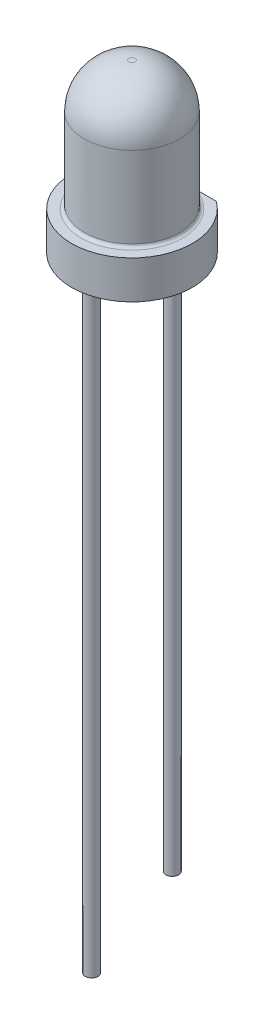
ISO-10303-21;
HEADER;
FILE_DESCRIPTION(('STEP AP214'),'2;1');
FILE_NAME('part.step','',(''),(''),'','','');
FILE_SCHEMA(('AUTOMOTIVE_DESIGN { 1 0 10303 214 1 1 1 1 }'));
ENDSEC;
DATA;
#1=APPLICATION_CONTEXT('core data for automotive mechanical design processes');
#2=APPLICATION_PROTOCOL_DEFINITION('international standard','automotive_design',2000,#1);
#3=PRODUCT_CONTEXT('',#1,'mechanical');
#4=PRODUCT('Part','Part','',(#3));
#5=PRODUCT_RELATED_PRODUCT_CATEGORY('part','',(#4));
#6=PRODUCT_DEFINITION_FORMATION('','',#4);
#7=PRODUCT_DEFINITION_CONTEXT('part definition',#1,'design');
#8=PRODUCT_DEFINITION('design','',#6,#7);
#9=PRODUCT_DEFINITION_SHAPE('','',#8);
#10=(LENGTH_UNIT() NAMED_UNIT(*) SI_UNIT(.MILLI.,.METRE.));
#11=(NAMED_UNIT(*) PLANE_ANGLE_UNIT() SI_UNIT($,.RADIAN.));
#12=(NAMED_UNIT(*) SI_UNIT($,.STERADIAN.) SOLID_ANGLE_UNIT());
#13=UNCERTAINTY_MEASURE_WITH_UNIT(LENGTH_MEASURE(1.E-05),#10,'distance_accuracy_value','');
#14=(GEOMETRIC_REPRESENTATION_CONTEXT(3) GLOBAL_UNCERTAINTY_ASSIGNED_CONTEXT((#13)) GLOBAL_UNIT_ASSIGNED_CONTEXT((#10,
#11,#12)) REPRESENTATION_CONTEXT('',''));
#15=CARTESIAN_POINT('',(0.,0.,0.));
#16=DIRECTION('',(0.,0.,1.));
#17=DIRECTION('',(1.,0.,0.));
#18=AXIS2_PLACEMENT_3D('',#15,#16,#17);
#19=CARTESIAN_POINT('',(0.,0.,0.));
#20=DIRECTION('',(0.,-1.,0.));
#21=DIRECTION('',(0.,0.,-1.));
#22=AXIS2_PLACEMENT_3D('',#19,#20,#21);
#23=PLANE('',#22);
#24=CARTESIAN_POINT('',(0.,0.,-1.27));
#25=DIRECTION('',(0.,-1.,0.));
#26=DIRECTION('',(0.,0.,-1.));
#27=AXIS2_PLACEMENT_3D('',#24,#25,#26);
#28=CIRCLE('',#27,0.2);
#29=CARTESIAN_POINT('',(0.,0.,-1.47));
#30=VERTEX_POINT('',#29);
#31=EDGE_CURVE('E312',#30,#30,#28,.T.);
#32=ORIENTED_EDGE('',*,*,#31,.F.);
#33=EDGE_LOOP('',(#32));
#34=FACE_BOUND('',#33,.T.);
#35=CARTESIAN_POINT('',(0.,0.,1.27));
#36=DIRECTION('',(0.,-1.,0.));
#37=DIRECTION('',(0.,0.,-1.));
#38=AXIS2_PLACEMENT_3D('',#35,#36,#37);
#39=CIRCLE('',#38,0.2);
#40=CARTESIAN_POINT('',(0.,0.,1.07));
#41=VERTEX_POINT('',#40);
#42=EDGE_CURVE('E133',#41,#41,#39,.T.);
#43=ORIENTED_EDGE('',*,*,#42,.F.);
#44=EDGE_LOOP('',(#43));
#45=FACE_BOUND('',#44,.T.);
#46=CARTESIAN_POINT('',(0.,0.,0.));
#47=DIRECTION('',(0.,-1.,0.));
#48=DIRECTION('',(0.,0.,-1.));
#49=AXIS2_PLACEMENT_3D('',#46,#47,#48);
#50=CIRCLE('',#49,1.9);
#51=CARTESIAN_POINT('',(1.15393997640077,0.,-1.50944444444445));
#52=VERTEX_POINT('',#51);
#53=CARTESIAN_POINT('',(-1.15393997640077,0.,-1.50944444444445));
#54=VERTEX_POINT('',#53);
#55=EDGE_CURVE('E126',#52,#54,#50,.T.);
#56=ORIENTED_EDGE('',*,*,#55,.T.);
#57=CARTESIAN_POINT('',(-1.09320629343231,0.,-1.43));
#58=DIRECTION('',(0.,-1.,0.));
#59=DIRECTION('',(0.,0.,-1.));
#60=AXIS2_PLACEMENT_3D('',#57,#58,#59);
#61=CIRCLE('',#60,0.1);
#62=CARTESIAN_POINT('',(-1.09320629343231,0.,-1.53));
#63=VERTEX_POINT('',#62);
#64=EDGE_CURVE('E182',#54,#63,#61,.T.);
#65=ORIENTED_EDGE('',*,*,#64,.T.);
#66=DIRECTION('',(1.,0.,0.));
#67=VECTOR('',#66,1.);
#68=CARTESIAN_POINT('',(-1.5,0.,-1.53));
#69=LINE('',#68,#67);
#70=CARTESIAN_POINT('',(1.09320629343231,0.,-1.53));
#71=VERTEX_POINT('',#70);
#72=EDGE_CURVE('E116',#63,#71,#69,.T.);
#73=ORIENTED_EDGE('',*,*,#72,.T.);
#74=CARTESIAN_POINT('',(1.09320629343231,0.,-1.43));
#75=DIRECTION('',(0.,-1.,0.));
#76=DIRECTION('',(0.,0.,-1.));
#77=AXIS2_PLACEMENT_3D('',#74,#75,#76);
#78=CIRCLE('',#77,0.1);
#79=EDGE_CURVE('E209',#71,#52,#78,.T.);
#80=ORIENTED_EDGE('',*,*,#79,.T.);
#81=EDGE_LOOP('',(#56,#65,#73,#80));
#82=FACE_BOUND('',#81,.T.);
#83=ADVANCED_FACE('F36',(#34,#45,#82),#23,.T.);
#84=CARTESIAN_POINT('',(0.1,5.25,0.));
#85=DIRECTION('',(0.,1.,0.));
#86=DIRECTION('',(0.,0.,1.));
#87=AXIS2_PLACEMENT_3D('',#84,#85,#86);
#88=PLANE('',#87);
#89=CARTESIAN_POINT('',(0.,5.25,0.));
#90=DIRECTION('',(0.,-1.,0.));
#91=DIRECTION('',(0.,0.,-1.));
#92=AXIS2_PLACEMENT_3D('',#89,#90,#91);
#93=CIRCLE('',#92,0.1);
#94=CARTESIAN_POINT('',(0.,5.25,-0.1));
#95=VERTEX_POINT('',#94);
#96=EDGE_CURVE('E194',#95,#95,#93,.T.);
#97=ORIENTED_EDGE('',*,*,#96,.F.);
#98=EDGE_LOOP('',(#97));
#99=FACE_BOUND('',#98,.T.);
#100=ADVANCED_FACE('F161',(#99),#88,.T.);
#101=CARTESIAN_POINT('',(0.,3.85,0.));
#102=DIRECTION('',(0.,-1.,0.));
#103=DIRECTION('',(0.,0.,-1.));
#104=AXIS2_PLACEMENT_3D('',#101,#102,#103);
#105=DEGENERATE_TOROIDAL_SURFACE('',#104,0.1,1.4,.T.);
#106=ORIENTED_EDGE('',*,*,#96,.T.);
#107=EDGE_LOOP('',(#106));
#108=FACE_BOUND('',#107,.T.);
#109=CARTESIAN_POINT('',(0.,3.85,0.));
#110=DIRECTION('',(0.,-1.,0.));
#111=DIRECTION('',(0.,0.,-1.));
#112=AXIS2_PLACEMENT_3D('',#109,#110,#111);
#113=CIRCLE('',#112,1.5);
#114=CARTESIAN_POINT('',(0.,3.85,-1.5));
#115=VERTEX_POINT('',#114);
#116=EDGE_CURVE('E197',#115,#115,#113,.T.);
#117=ORIENTED_EDGE('',*,*,#116,.F.);
#118=EDGE_LOOP('',(#117));
#119=FACE_BOUND('',#118,.T.);
#120=ADVANCED_FACE('F167',(#108,#119),#105,.T.);
#121=CARTESIAN_POINT('',(0.,0.,0.));
#122=DIRECTION('',(0.,-1.,0.));
#123=DIRECTION('',(0.,0.,-1.));
#124=AXIS2_PLACEMENT_3D('',#121,#122,#123);
#125=CYLINDRICAL_SURFACE('',#124,1.5);
#126=CARTESIAN_POINT('',(0.596635949045258,1.27844838329799,-1.37623600603489));
#127=CARTESIAN_POINT('',(0.579988654836086,1.22074362828819,-1.38345306338259));
#128=CARTESIAN_POINT('',(0.593571128968101,1.19395535467138,-1.43595984261225));
#129=CARTESIAN_POINT('',(0.607153603100116,1.16716708105457,-1.4884666218419));
#130=CARTESIAN_POINT('',(0.636411678981608,1.2,-1.53));
#131=CARTESIAN_POINT('',(0.585036841780166,1.28263813999001,-1.38126781091185));
#132=CARTESIAN_POINT('',(0.571302463719679,1.22599416612077,-1.38706443709447));
#133=CARTESIAN_POINT('',(0.584305659045327,1.19828171330966,-1.43698733020298));
#134=CARTESIAN_POINT('',(0.597479746886338,1.17050639970074,-1.48687857662004));
#135=CARTESIAN_POINT('',(0.624039297898998,1.2,-1.53));
#136=CARTESIAN_POINT('',(0.573187867718047,1.28599119272939,-1.38622735770545));
#137=CARTESIAN_POINT('',(0.561678229660388,1.23060501398405,-1.39097132711862));
#138=CARTESIAN_POINT('',(0.574226791445767,1.20220692852279,-1.43848650602435));
#139=CARTESIAN_POINT('',(0.586930229864933,1.17376106597824,-1.48597256818874));
#140=CARTESIAN_POINT('',(0.61140039223266,1.2,-1.53));
#141=CARTESIAN_POINT('',(0.549178576915518,1.2913921514648,-1.39591095345598));
#142=CARTESIAN_POINT('',(0.541297577119814,1.2386162598478,-1.3989909676858));
#143=CARTESIAN_POINT('',(0.552983697349845,1.2092767962256,-1.44206424442007));
#144=CARTESIAN_POINT('',(0.564815785403716,1.17988505157303,-1.48511591745898));
#145=CARTESIAN_POINT('',(0.585790482043143,1.2,-1.53));
#146=CARTESIAN_POINT('',(0.537019422386753,1.29344434684456,-1.40063572853451));
#147=CARTESIAN_POINT('',(0.530537683708682,1.24204647830918,-1.40310920461877));
#148=CARTESIAN_POINT('',(0.541823179280551,1.21242399295138,-1.44414087000428));
#149=CARTESIAN_POINT('',(0.553243424841939,1.18276788571251,-1.48514789033228));
#150=CARTESIAN_POINT('',(0.572820717212384,1.2,-1.53));
#151=CARTESIAN_POINT('',(0.512616344627985,1.2966193956014,-1.40974943255995));
#152=CARTESIAN_POINT('',(0.508480507002836,1.24788019580522,-1.41124206800611));
#153=CARTESIAN_POINT('',(0.518999560235381,1.2179612194423,-1.44850016292976));
#154=CARTESIAN_POINT('',(0.529651702044954,1.18801086515299,-1.48573176900494));
#155=CARTESIAN_POINT('',(0.546790767603336,1.2,-1.53));
#156=CARTESIAN_POINT('',(0.500374338951784,1.29775093441029,-1.41414113720348));
#157=CARTESIAN_POINT('',(0.497178556171205,1.25030934586726,-1.41526471895034));
#158=CARTESIAN_POINT('',(0.507342274687659,1.22035819106882,-1.4507806739017));
#159=CARTESIAN_POINT('',(0.517624678401709,1.19038570693231,-1.48627323443446));
#160=CARTESIAN_POINT('',(0.533732628215766,1.2,-1.53));
#161=CARTESIAN_POINT('',(0.475735547941032,1.29931674867054,-1.42261924900392));
#162=CARTESIAN_POINT('',(0.47412551748095,1.25438269775188,-1.42314955042351));
#163=CARTESIAN_POINT('',(0.483596203260389,1.2245481664658,-1.45542113040316));
#164=CARTESIAN_POINT('',(0.49318342175339,1.1946934570346,-1.48767013672499));
#165=CARTESIAN_POINT('',(0.507451251137652,1.2,-1.53));
#166=CARTESIAN_POINT('',(0.463338632072527,1.2997503896142,-1.426705375124));
#167=CARTESIAN_POINT('',(0.462361785715185,1.25603684322798,-1.42701885718742));
#168=CARTESIAN_POINT('',(0.47150703491985,1.22634061945737,-1.45778114622854));
#169=CARTESIAN_POINT('',(0.480754989806089,1.19663341865014,-1.48852378191264));
#170=CARTESIAN_POINT('',(0.494227874210891,1.2,-1.53));
#171=CARTESIAN_POINT('',(0.41471094272655,1.30041340749933,-1.44203056474712));
#172=CARTESIAN_POINT('',(0.416213299518517,1.261222769485,-1.44154104006249));
#173=CARTESIAN_POINT('',(0.423733878620772,1.23235282442122,-1.46692270832985));
#174=CARTESIAN_POINT('',(0.432123864507955,1.20336789692869,-1.49213801328945));
#175=CARTESIAN_POINT('',(0.44235833890775,1.2,-1.53));
#176=CARTESIAN_POINT('',(0.378077766422061,1.29867898574596,-1.45206286838238));
#177=CARTESIAN_POINT('',(0.380169640792389,1.26255365008559,-1.45151257699511));
#178=CARTESIAN_POINT('',(0.38698553795431,1.23468939564989,-1.47356029599259));
#179=CARTESIAN_POINT('',(0.394401907167303,1.20679996719503,-1.49551475520822));
#180=CARTESIAN_POINT('',(0.4032829508504,1.2,-1.53));
#181=CARTESIAN_POINT('',(0.30425871854931,1.2932828552766,-1.46930957357808));
#182=CARTESIAN_POINT('',(0.307079951419319,1.26250202741913,-1.46871132062124));
#183=CARTESIAN_POINT('',(0.31233461227565,1.23698092941371,-1.48535267215074));
#184=CARTESIAN_POINT('',(0.318173795207326,1.21144853710192,-1.50190011559484));
#185=CARTESIAN_POINT('',(0.324542633119835,1.2,-1.53));
#186=CARTESIAN_POINT('',(0.267071892964728,1.28961732179085,-1.47651833323522));
#187=CARTESIAN_POINT('',(0.269807489469149,1.26115657812262,-1.47603269280316));
#188=CARTESIAN_POINT('',(0.274429877766994,1.23693114785473,-1.49050448646882));
#189=CARTESIAN_POINT('',(0.279427902981026,1.21271070690526,-1.50493476730807));
#190=CARTESIAN_POINT('',(0.284876685829209,1.2,-1.53));
#191=CARTESIAN_POINT('',(0.192041759882336,1.28223633010451,-1.48814264083676));
#192=CARTESIAN_POINT('',(0.194448175117998,1.2576845929024,-1.48783135106648));
#193=CARTESIAN_POINT('',(0.197652369009453,1.23588414150975,-1.49894144908285));
#194=CARTESIAN_POINT('',(0.201230232249616,1.21408891846235,-1.51001071885433));
#195=CARTESIAN_POINT('',(0.204844543874352,1.2,-1.53));
#196=CARTESIAN_POINT('',(0.154195919935727,1.27852070647174,-1.49254204929815));
#197=CARTESIAN_POINT('',(0.156163965999515,1.25555199056608,-1.49235163064919));
#198=CARTESIAN_POINT('',(0.158775311449008,1.23488152319566,-1.50221580073815));
#199=CARTESIAN_POINT('',(0.161573097274758,1.21421329490168,-1.51206957814087));
#200=CARTESIAN_POINT('',(0.164475647931405,1.2,-1.53));
#201=CARTESIAN_POINT('',(0.078213791192061,1.27313765714223,-1.49844202742775));
#202=CARTESIAN_POINT('',(0.0793316733717928,1.25236443947991,-1.49839249164291));
#203=CARTESIAN_POINT('',(0.0805991124199562,1.23329053926251,-1.50662579467846));
#204=CARTESIAN_POINT('',(0.0820482117256914,1.21422188025386,-1.51484872637576));
#205=CARTESIAN_POINT('',(0.0834280439382357,1.2,-1.53));
#206=CARTESIAN_POINT('',(0.0400784190140926,1.27146533050907,-1.49994953841275));
#207=CARTESIAN_POINT('',(0.0406074388213395,1.25129448361804,-1.49994828479541));
#208=CARTESIAN_POINT('',(0.0413012098826571,1.23270118386836,-1.50776655797306));
#209=CARTESIAN_POINT('',(0.0419976948104199,1.21410780763926,-1.51558492151257));
#210=CARTESIAN_POINT('',(0.0427503136150422,1.2,-1.53));
#211=CARTESIAN_POINT('',(-0.0369667796354504,1.27136485923424,-1.50004894388315));
#212=CARTESIAN_POINT('',(-0.037451767744919,1.25123255682875,-1.5000501519944));
#213=CARTESIAN_POINT('',(-0.0380946287051991,1.23266827187658,-1.50784140770821));
#214=CARTESIAN_POINT('',(-0.0387339859337747,1.2141040675329,-1.51563256534065));
#215=CARTESIAN_POINT('',(-0.0394312316111574,1.2,-1.53));
#216=CARTESIAN_POINT('',(-0.0758767848599048,1.27300251396075,-1.49858170121813));
#217=CARTESIAN_POINT('',(-0.0769686631054567,1.2522824653133,-1.49853559503684));
#218=CARTESIAN_POINT('',(-0.0781927885150225,1.23324795415863,-1.50673073642604));
#219=CARTESIAN_POINT('',(-0.0796032813064427,1.21421892907304,-1.51491531115792));
#220=CARTESIAN_POINT('',(-0.0809352371839013,1.2,-1.53));
#221=CARTESIAN_POINT('',(-0.153405059561358,1.27843408641926,-1.49264377719626));
#222=CARTESIAN_POINT('',(-0.15536898568105,1.25550238502165,-1.49245548351361));
#223=CARTESIAN_POINT('',(-0.157963440051553,1.23485815676662,-1.50229127066718));
#224=CARTESIAN_POINT('',(-0.160749384521687,1.21421605686533,-1.51211659706847));
#225=CARTESIAN_POINT('',(-0.163632063532112,1.2,-1.53));
#226=CARTESIAN_POINT('',(-0.192022281181801,1.28223371326418,-1.48816513794087));
#227=CARTESIAN_POINT('',(-0.194439211654154,1.2576886068525,-1.4878523459794));
#228=CARTESIAN_POINT('',(-0.197634520231691,1.23588986910119,-1.49895659925115));
#229=CARTESIAN_POINT('',(-0.201220003891631,1.21409658323617,-1.510018136887));
#230=CARTESIAN_POINT('',(-0.204823766593921,1.2,-1.53));
#231=CARTESIAN_POINT('',(-0.268660382395489,1.28977423475865,-1.47625242622609));
#232=CARTESIAN_POINT('',(-0.271409661781654,1.26122578895328,-1.47576172149049));
#233=CARTESIAN_POINT('',(-0.276053266062757,1.23694716925973,-1.49031267276247));
#234=CARTESIAN_POINT('',(-0.281091372471785,1.21267367601031,-1.50481984447215));
#235=CARTESIAN_POINT('',(-0.286571074555189,1.2,-1.53));
#236=CARTESIAN_POINT('',(-0.306682829490062,1.29351528382897,-1.46882833250248));
#237=CARTESIAN_POINT('',(-0.309517382781105,1.26258105276251,-1.46822109991684));
#238=CARTESIAN_POINT('',(-0.314803586057846,1.23697612531768,-1.48501008854549));
#239=CARTESIAN_POINT('',(-0.320708404402393,1.21135833529395,-1.50169876563366));
#240=CARTESIAN_POINT('',(-0.327128351456066,1.2,-1.53));
#241=CARTESIAN_POINT('',(-0.38211659886271,1.29891233437488,-1.45102703848495));
#242=CARTESIAN_POINT('',(-0.384160774280792,1.26247032543957,-1.4504823096191));
#243=CARTESIAN_POINT('',(-0.391049347918864,1.23448669578774,-1.47286822446213));
#244=CARTESIAN_POINT('',(-0.398572869870511,1.20647489908179,-1.49515485007498));
#245=CARTESIAN_POINT('',(-0.40759103878689,1.2,-1.53));
#246=CARTESIAN_POINT('',(-0.419529334626983,1.30057414689707,-1.44065816834881));
#247=CARTESIAN_POINT('',(-0.4209412107273,1.26096487084678,-1.4401839984387));
#248=CARTESIAN_POINT('',(-0.428548000768911,1.23197544529759,-1.46603329061811));
#249=CARTESIAN_POINT('',(-0.437079374618921,1.20285817027594,-1.49170446778168));
#250=CARTESIAN_POINT('',(-0.447497956935449,1.2,-1.53));
#251=CARTESIAN_POINT('',(-0.468791184304815,1.29957738484036,-1.4249221530695));
#252=CARTESIAN_POINT('',(-0.467539174030466,1.25533306146782,-1.42532998072905));
#253=CARTESIAN_POINT('',(-0.476829345937057,1.22557093742464,-1.45674740230909));
#254=CARTESIAN_POINT('',(-0.486222733276246,1.19579689151023,-1.48814507156556));
#255=CARTESIAN_POINT('',(-0.500043929925136,1.2,-1.53));
#256=CARTESIAN_POINT('',(-0.481078358933183,1.29905844422898,-1.42082037197495));
#257=CARTESIAN_POINT('',(-0.479162158946364,1.25358914282929,-1.42146038584177));
#258=CARTESIAN_POINT('',(-0.488779133791034,1.22371054839857,-1.4544069674999));
#259=CARTESIAN_POINT('',(-0.498513274808875,1.19380982550644,-1.48733118860187));
#260=CARTESIAN_POINT('',(-0.513150249528728,1.2,-1.53));
#261=CARTESIAN_POINT('',(-0.505524926485509,1.29729897943894,-1.41230757412135));
#262=CARTESIAN_POINT('',(-0.50194085216485,1.24931724873431,-1.41358324462378));
#263=CARTESIAN_POINT('',(-0.51225544594631,1.21937200423796,-1.44982187734587));
#264=CARTESIAN_POINT('',(-0.522689394944279,1.18940518358734,-1.48603666998433));
#265=CARTESIAN_POINT('',(-0.539226588251209,1.2,-1.53));
#266=CARTESIAN_POINT('',(-0.517684019402311,1.29605703333797,-1.40789596310237));
#267=CARTESIAN_POINT('',(-0.513107339978204,1.24677661967967,-1.40956831709867));
#268=CARTESIAN_POINT('',(-0.523781088462639,1.21689263727398,-1.44757742012227));
#269=CARTESIAN_POINT('',(-0.534587524046544,1.18697917026052,-1.48555916245719));
#270=CARTESIAN_POINT('',(-0.552196287362465,1.2,-1.53));
#271=CARTESIAN_POINT('',(-0.52974592643691,1.2943624851959,-1.4033421726092));
#272=CARTESIAN_POINT('',(-0.523882563776283,1.24377450108468,-1.40555552623408));
#273=CARTESIAN_POINT('',(-0.535005835081248,1.21405404063005,-1.44544774550345));
#274=CARTESIAN_POINT('',(-0.546129106386214,1.18433358017542,-1.48533996477283));
#275=CARTESIAN_POINT('',(-0.565062321532704,1.2,-1.53));
#276=(BOUNDED_SURFACE() B_SPLINE_SURFACE(3,2,((#126,#127,#128,#129,#130),(#131,#132,#133,#134,
#135),(#136,#137,#138,#139,#140),(#141,#142,#143,#144,#145),(#146,#147,#148,#149,#150),(#151,
#152,#153,#154,#155),(#156,#157,#158,#159,#160),(#161,#162,#163,#164,#165),(#166,#167,#168,#169,
#170),(#171,#172,#173,#174,#175),(#176,#177,#178,#179,#180),(#181,#182,#183,#184,#185),(#186,
#187,#188,#189,#190),(#191,#192,#193,#194,#195),(#196,#197,#198,#199,#200),(#201,#202,#203,#204,
#205),(#206,#207,#208,#209,#210),(#211,#212,#213,#214,#215),(#216,#217,#218,#219,#220),(#221,
#222,#223,#224,#225),(#226,#227,#228,#229,#230),(#231,#232,#233,#234,#235),(#236,#237,#238,#239,
#240),(#241,#242,#243,#244,#245),(#246,#247,#248,#249,#250),(#251,#252,#253,#254,#255),(#256,
#257,#258,#259,#260),(#261,#262,#263,#264,#265),(#266,#267,#268,#269,#270),(#271,#272,#273,#274,
#275)),.UNSPECIFIED.,.F.,.F.,.F.) B_SPLINE_SURFACE_WITH_KNOTS((4,2,2,2,2,2,2,2,2,2,2,2,2,2,4),
(3,2,3),(0.,0.0422764840743587,0.0844128324877446,0.126146902745886,0.167918894971379,
0.28928862457798,0.410899648455466,0.533203176922212,0.655212775535734,0.779671660012366,
0.904460738177825,1.02883061205741,1.15285211513145,1.19431278140056,1.23585526443215),(0.,0.5,
1.),.UNSPECIFIED.) GEOMETRIC_REPRESENTATION_ITEM() RATIONAL_B_SPLINE_SURFACE(((1.,
0.85563716515644,1.,0.85563716515644,1.),(1.,0.863021020647195,1.,0.863021020647195,1.),(1.,
0.869758422118352,1.,0.869758422118352,1.),(1.,0.882160721151865,1.,0.882160721151865,1.),(1.,
0.88782909976125,1.,0.88782909976125,1.),(1.,0.898309242198533,1.,0.898309242198533,1.),(1.,
0.903128667525479,1.,0.903128667525479,1.),(1.,0.91211879180689,1.,0.91211879180689,1.),(1.,
0.916288897312207,1.,0.916288897312207,1.),(1.,0.931529217847124,1.,0.931529217847124,1.),(1.,
0.940605969691848,1.,0.940605969691848,1.),(1.,0.955654895603525,1.,0.955654895603525,1.),(1.,
0.961620861606153,1.,0.961620861606153,1.),(1.,0.971051666979564,1.,0.971051666979564,1.),(1.,
0.974502070422679,1.,0.974502070422679,1.),(1.,0.979101248220992,1.,0.979101248220992,1.),(1.,
0.980255534110944,1.,0.980255534110944,1.),(1.,0.980332213292014,1.,0.980332213292014,1.),(1.,
0.97920933721665,1.,0.97920933721665,1.),(1.,0.974582188133946,1.,0.974582188133946,1.),(1.,
0.97107160510234,1.,0.97107160510234,1.),(1.,0.961403426510486,1.,0.961403426510486,1.),(1.,
0.955254762683174,1.,0.955254762683174,1.),(1.,0.939678908407238,1.,0.939678908407238,1.),(1.,
0.930260949639035,1.,0.930260949639035,1.),(1.,0.91447462621072,1.,0.91447462621072,1.),(1.,
0.910249755048433,1.,0.910249755048433,1.),(1.,0.901125501382839,1.,0.901125501382839,1.),(1.,
0.896224804279032,1.,0.896224804279032,1.),(1.,0.890926593829613,1.,0.890926593829613,1.))) REPRESENTATION_ITEM('') SURFACE());
#277=CARTESIAN_POINT('',(0.596635949045258,1.27844838329799,-1.37623600603489));
#278=CARTESIAN_POINT('',(0.585036841780166,1.28263813999001,-1.38126781091185));
#279=CARTESIAN_POINT('',(0.573187867718047,1.28599119272939,-1.38622735770545));
#280=CARTESIAN_POINT('',(0.549178576915518,1.2913921514648,-1.39591095345598));
#281=CARTESIAN_POINT('',(0.537019422386753,1.29344434684455,-1.40063572853451));
#282=CARTESIAN_POINT('',(0.512616344627985,1.2966193956014,-1.40974943255995));
#283=CARTESIAN_POINT('',(0.500374338951784,1.29775093441029,-1.41414113720348));
#284=CARTESIAN_POINT('',(0.475735547941032,1.29931674867054,-1.42261924900392));
#285=CARTESIAN_POINT('',(0.463338632072527,1.2997503896142,-1.426705375124));
#286=CARTESIAN_POINT('',(0.41471094272655,1.30041340749933,-1.44203056474712));
#287=CARTESIAN_POINT('',(0.378077766422061,1.29867898574596,-1.45206286838238));
#288=CARTESIAN_POINT('',(0.30425871854931,1.2932828552766,-1.46930957357808));
#289=CARTESIAN_POINT('',(0.267071892964728,1.28961732179085,-1.47651833323522));
#290=CARTESIAN_POINT('',(0.192041759882336,1.28223633010451,-1.48814264083676));
#291=CARTESIAN_POINT('',(0.154195919935727,1.27852070647174,-1.49254204929814));
#292=CARTESIAN_POINT('',(0.078213791192061,1.27313765714222,-1.49844202742775));
#293=CARTESIAN_POINT('',(0.0400784190140926,1.27146533050907,-1.49994953841275));
#294=CARTESIAN_POINT('',(-0.0369667796354504,1.27136485923424,-1.50004894388315));
#295=CARTESIAN_POINT('',(-0.0758767848599049,1.27300251396075,-1.49858170121813));
#296=CARTESIAN_POINT('',(-0.153405059561358,1.27843408641926,-1.49264377719626));
#297=CARTESIAN_POINT('',(-0.192022281181801,1.28223371326418,-1.48816513794087));
#298=CARTESIAN_POINT('',(-0.268660382395489,1.28977423475865,-1.47625242622609));
#299=CARTESIAN_POINT('',(-0.306682829490062,1.29351528382897,-1.46882833250248));
#300=CARTESIAN_POINT('',(-0.38211659886271,1.29891233437488,-1.45102703848495));
#301=CARTESIAN_POINT('',(-0.419529334626983,1.30057414689707,-1.44065816834881));
#302=CARTESIAN_POINT('',(-0.468791184304815,1.29957738484036,-1.4249221530695));
#303=CARTESIAN_POINT('',(-0.481078358933183,1.29905844422898,-1.42082037197495));
#304=CARTESIAN_POINT('',(-0.505524926485509,1.29729897943894,-1.41230757412135));
#305=CARTESIAN_POINT('',(-0.517684019402311,1.29605703333797,-1.40789596310237));
#306=CARTESIAN_POINT('',(-0.52974592643691,1.2943624851959,-1.4033421726092));
#307=B_SPLINE_CURVE_WITH_KNOTS('',3,(#277,#278,#279,#280,#281,#282,#283,#284,#285,#286,#287,
#288,#289,#290,#291,#292,#293,#294,#295,#296,#297,#298,#299,#300,#301,#302,#303,#304,#305,#306),
.UNSPECIFIED.,.F.,.F.,(4,2,2,2,2,2,2,2,2,2,2,2,2,2,4),(0.,0.0422764840743587,0.0844128324877446,
0.126146902745886,0.167918894971379,0.28928862457798,0.410899648455466,0.533203176922212,
0.655212775535734,0.779671660012366,0.904460738177825,1.02883061205741,1.15285211513145,
1.19431278140056,1.23585526443215),.UNSPECIFIED.);
#308=CARTESIAN_POINT('',(0.438826115192566,1.3,-1.434375));
#309=VERTEX_POINT('',#308);
#310=CARTESIAN_POINT('',(-0.438826115192566,1.3,-1.434375));
#311=VERTEX_POINT('',#310);
#312=EDGE_CURVE('E50',#309,#311,#307,.T.);
#313=ORIENTED_EDGE('',*,*,#312,.T.);
#314=CARTESIAN_POINT('',(0.,1.3,0.));
#315=DIRECTION('',(0.,1.,0.));
#316=DIRECTION('',(0.,0.,1.));
#317=AXIS2_PLACEMENT_3D('',#314,#315,#316);
#318=CIRCLE('',#317,1.5);
#319=EDGE_CURVE('E11',#311,#309,#318,.T.);
#320=ORIENTED_EDGE('',*,*,#319,.T.);
#321=EDGE_LOOP('',(#313,#320));
#322=FACE_BOUND('',#321,.T.);
#323=ORIENTED_EDGE('',*,*,#116,.T.);
#324=EDGE_LOOP('',(#323));
#325=FACE_BOUND('',#324,.T.);
#326=ADVANCED_FACE('F159',(#322,#325),#125,.T.);
#327=CARTESIAN_POINT('',(1.9,1.2,0.));
#328=DIRECTION('',(0.,1.,0.));
#329=DIRECTION('',(0.,0.,1.));
#330=AXIS2_PLACEMENT_3D('',#327,#328,#329);
#331=PLANE('',#330);
#332=DIRECTION('',(1.,0.,0.));
#333=VECTOR('',#332,1.);
#334=CARTESIAN_POINT('',(-1.5,1.2,-1.53));
#335=LINE('',#334,#333);
#336=CARTESIAN_POINT('',(-1.09320629343231,1.2,-1.53));
#337=VERTEX_POINT('',#336);
#338=CARTESIAN_POINT('',(-0.468081189538737,1.2,-1.53));
#339=VERTEX_POINT('',#338);
#340=EDGE_CURVE('E113',#337,#339,#335,.T.);
#341=ORIENTED_EDGE('',*,*,#340,.F.);
#342=CARTESIAN_POINT('',(-1.09320629343231,1.2,-1.43));
#343=DIRECTION('',(0.,1.,0.));
#344=DIRECTION('',(0.,0.,1.));
#345=AXIS2_PLACEMENT_3D('',#342,#343,#344);
#346=CIRCLE('',#345,0.1);
#347=CARTESIAN_POINT('',(-1.15393997640077,1.2,-1.50944444444445));
#348=VERTEX_POINT('',#347);
#349=EDGE_CURVE('E95',#337,#348,#346,.T.);
#350=ORIENTED_EDGE('',*,*,#349,.T.);
#351=CARTESIAN_POINT('',(0.,1.2,0.));
#352=DIRECTION('',(0.,-1.,0.));
#353=DIRECTION('',(0.,0.,-1.));
#354=AXIS2_PLACEMENT_3D('',#351,#352,#353);
#355=CIRCLE('',#354,1.9);
#356=CARTESIAN_POINT('',(1.15393997640077,1.2,-1.50944444444445));
#357=VERTEX_POINT('',#356);
#358=EDGE_CURVE('E199',#357,#348,#355,.T.);
#359=ORIENTED_EDGE('',*,*,#358,.F.);
#360=CARTESIAN_POINT('',(1.09320629343231,1.2,-1.43));
#361=DIRECTION('',(0.,1.,0.));
#362=DIRECTION('',(0.,0.,1.));
#363=AXIS2_PLACEMENT_3D('',#360,#361,#362);
#364=CIRCLE('',#363,0.1);
#365=CARTESIAN_POINT('',(1.09320629343231,1.2,-1.53));
#366=VERTEX_POINT('',#365);
#367=EDGE_CURVE('E106',#357,#366,#364,.T.);
#368=ORIENTED_EDGE('',*,*,#367,.T.);
#369=CARTESIAN_POINT('',(0.468081189538737,1.2,-1.53));
#370=VERTEX_POINT('',#369);
#371=EDGE_CURVE('E125',#370,#366,#335,.T.);
#372=ORIENTED_EDGE('',*,*,#371,.F.);
#373=CARTESIAN_POINT('',(0.,1.2,0.));
#374=DIRECTION('',(0.,1.,0.));
#375=DIRECTION('',(0.,0.,1.));
#376=AXIS2_PLACEMENT_3D('',#373,#374,#375);
#377=CIRCLE('',#376,1.6);
#378=EDGE_CURVE('E117',#370,#339,#377,.F.);
#379=ORIENTED_EDGE('',*,*,#378,.T.);
#380=EDGE_LOOP('',(#341,#350,#359,#368,#372,#379));
#381=FACE_BOUND('',#380,.T.);
#382=ADVANCED_FACE('F120',(#381),#331,.T.);
#383=CARTESIAN_POINT('',(0.,0.,0.));
#384=DIRECTION('',(0.,-1.,0.));
#385=DIRECTION('',(0.,0.,-1.));
#386=AXIS2_PLACEMENT_3D('',#383,#384,#385);
#387=CYLINDRICAL_SURFACE('',#386,1.9);
#388=ORIENTED_EDGE('',*,*,#358,.T.);
#389=DIRECTION('',(0.,-1.,0.));
#390=VECTOR('',#389,1.);
#391=CARTESIAN_POINT('',(-1.15393997640077,0.,-1.50944444444445));
#392=LINE('',#391,#390);
#393=EDGE_CURVE('E100',#348,#54,#392,.T.);
#394=ORIENTED_EDGE('',*,*,#393,.T.);
#395=ORIENTED_EDGE('',*,*,#55,.F.);
#396=DIRECTION('',(0.,-1.,0.));
#397=VECTOR('',#396,1.);
#398=CARTESIAN_POINT('',(1.15393997640077,0.,-1.50944444444445));
#399=LINE('',#398,#397);
#400=EDGE_CURVE('E105',#52,#357,#399,.F.);
#401=ORIENTED_EDGE('',*,*,#400,.T.);
#402=EDGE_LOOP('',(#388,#394,#395,#401));
#403=FACE_BOUND('',#402,.T.);
#404=ADVANCED_FACE('F151',(#403),#387,.T.);
#405=CARTESIAN_POINT('',(-1.5,-3.04138126514911,-1.53));
#406=DIRECTION('',(0.,0.,1.));
#407=DIRECTION('',(1.,0.,0.));
#408=AXIS2_PLACEMENT_3D('',#405,#406,#407);
#409=PLANE('',#408);
#410=ORIENTED_EDGE('',*,*,#72,.F.);
#411=DIRECTION('',(0.,1.,0.));
#412=VECTOR('',#411,1.);
#413=CARTESIAN_POINT('',(-1.09320629343231,1.2,-1.53));
#414=LINE('',#413,#412);
#415=EDGE_CURVE('E99',#63,#337,#414,.T.);
#416=ORIENTED_EDGE('',*,*,#415,.T.);
#417=ORIENTED_EDGE('',*,*,#340,.T.);
#418=EDGE_CURVE('E123',#339,#370,#335,.T.);
#419=ORIENTED_EDGE('',*,*,#418,.T.);
#420=ORIENTED_EDGE('',*,*,#371,.T.);
#421=DIRECTION('',(0.,1.,0.));
#422=VECTOR('',#421,1.);
#423=CARTESIAN_POINT('',(1.09320629343231,0.,-1.53));
#424=LINE('',#423,#422);
#425=EDGE_CURVE('E118',#366,#71,#424,.F.);
#426=ORIENTED_EDGE('',*,*,#425,.T.);
#427=EDGE_LOOP('',(#410,#416,#417,#419,#420,#426));
#428=FACE_BOUND('',#427,.T.);
#429=ADVANCED_FACE('F111',(#428),#409,.F.);
#430=CARTESIAN_POINT('',(-1.09320629343231,0.,-1.43));
#431=DIRECTION('',(0.,-1.,0.));
#432=DIRECTION('',(0.,0.,-1.));
#433=AXIS2_PLACEMENT_3D('',#430,#431,#432);
#434=CYLINDRICAL_SURFACE('',#433,0.1);
#435=ORIENTED_EDGE('',*,*,#64,.F.);
#436=ORIENTED_EDGE('',*,*,#393,.F.);
#437=ORIENTED_EDGE('',*,*,#349,.F.);
#438=ORIENTED_EDGE('',*,*,#415,.F.);
#439=EDGE_LOOP('',(#435,#436,#437,#438));
#440=FACE_BOUND('',#439,.T.);
#441=ADVANCED_FACE('F98',(#440),#434,.T.);
#442=CARTESIAN_POINT('',(1.09320629343231,0.,-1.43));
#443=DIRECTION('',(0.,-1.,0.));
#444=DIRECTION('',(0.,0.,-1.));
#445=AXIS2_PLACEMENT_3D('',#442,#443,#444);
#446=CYLINDRICAL_SURFACE('',#445,0.1);
#447=ORIENTED_EDGE('',*,*,#367,.F.);
#448=ORIENTED_EDGE('',*,*,#400,.F.);
#449=ORIENTED_EDGE('',*,*,#79,.F.);
#450=ORIENTED_EDGE('',*,*,#425,.F.);
#451=EDGE_LOOP('',(#447,#448,#449,#450));
#452=FACE_BOUND('',#451,.T.);
#453=ADVANCED_FACE('F216',(#452),#446,.T.);
#454=CARTESIAN_POINT('',(0.,1.3,0.));
#455=DIRECTION('',(0.,1.,0.));
#456=DIRECTION('',(0.,0.,1.));
#457=AXIS2_PLACEMENT_3D('',#454,#455,#456);
#458=TOROIDAL_SURFACE('',#457,1.6,0.1);
#459=CARTESIAN_POINT('',(0.468081189538737,1.3,-1.53));
#460=DIRECTION('',(0.95625,0.,0.29255074346171));
#461=DIRECTION('',(0.29255074346171,0.,-0.95625));
#462=AXIS2_PLACEMENT_3D('',#459,#460,#461);
#463=CIRCLE('',#462,0.1);
#464=EDGE_CURVE('E131',#309,#370,#463,.T.);
#465=ORIENTED_EDGE('',*,*,#464,.F.);
#466=ORIENTED_EDGE('',*,*,#319,.F.);
#467=CARTESIAN_POINT('',(-0.468081189538737,1.3,-1.53));
#468=DIRECTION('',(-0.95625,0.,0.29255074346171));
#469=DIRECTION('',(0.29255074346171,0.,0.95625));
#470=AXIS2_PLACEMENT_3D('',#467,#468,#469);
#471=CIRCLE('',#470,0.1);
#472=EDGE_CURVE('E58',#339,#311,#471,.T.);
#473=ORIENTED_EDGE('',*,*,#472,.F.);
#474=ORIENTED_EDGE('',*,*,#378,.F.);
#475=EDGE_LOOP('',(#465,#466,#473,#474));
#476=FACE_BOUND('',#475,.T.);
#477=ADVANCED_FACE('F38',(#476),#458,.F.);
#478=ORIENTED_EDGE('',*,*,#472,.T.);
#479=ORIENTED_EDGE('',*,*,#312,.F.);
#480=ORIENTED_EDGE('',*,*,#464,.T.);
#481=ORIENTED_EDGE('',*,*,#418,.F.);
#482=EDGE_LOOP('',(#478,#479,#480,#481));
#483=FACE_BOUND('',#482,.T.);
#484=ADVANCED_FACE('F141',(#483),#276,.F.);
#485=CARTESIAN_POINT('',(0.,-17.5,1.27));
#486=DIRECTION('',(0.,1.,0.));
#487=DIRECTION('',(0.,0.,1.));
#488=AXIS2_PLACEMENT_3D('',#485,#486,#487);
#489=CYLINDRICAL_SURFACE('',#488,0.2);
#490=ORIENTED_EDGE('',*,*,#42,.T.);
#491=EDGE_LOOP('',(#490));
#492=FACE_BOUND('',#491,.T.);
#493=CARTESIAN_POINT('',(0.,-19.,1.27));
#494=DIRECTION('',(0.,-1.,0.));
#495=DIRECTION('',(0.,0.,-1.));
#496=AXIS2_PLACEMENT_3D('',#493,#494,#495);
#497=CIRCLE('',#496,0.2);
#498=CARTESIAN_POINT('',(0.,-19.,1.07));
#499=VERTEX_POINT('',#498);
#500=EDGE_CURVE('E310',#499,#499,#497,.T.);
#501=ORIENTED_EDGE('',*,*,#500,.F.);
#502=EDGE_LOOP('',(#501));
#503=FACE_BOUND('',#502,.T.);
#504=ADVANCED_FACE('F152',(#492,#503),#489,.T.);
#505=CARTESIAN_POINT('',(0.,-17.5,-1.27));
#506=DIRECTION('',(0.,1.,0.));
#507=DIRECTION('',(0.,0.,1.));
#508=AXIS2_PLACEMENT_3D('',#505,#506,#507);
#509=CYLINDRICAL_SURFACE('',#508,0.2);
#510=CARTESIAN_POINT('',(0.,-17.5,-1.27));
#511=DIRECTION('',(0.,-1.,0.));
#512=DIRECTION('',(0.,0.,-1.));
#513=AXIS2_PLACEMENT_3D('',#510,#511,#512);
#514=CIRCLE('',#513,0.2);
#515=CARTESIAN_POINT('',(0.,-17.5,-1.47));
#516=VERTEX_POINT('',#515);
#517=EDGE_CURVE('E315',#516,#516,#514,.T.);
#518=ORIENTED_EDGE('',*,*,#517,.F.);
#519=EDGE_LOOP('',(#518));
#520=FACE_BOUND('',#519,.T.);
#521=ORIENTED_EDGE('',*,*,#31,.T.);
#522=EDGE_LOOP('',(#521));
#523=FACE_BOUND('',#522,.T.);
#524=ADVANCED_FACE('F271',(#520,#523),#509,.T.);
#525=CARTESIAN_POINT('',(0.,-17.5,-1.27));
#526=DIRECTION('',(0.,-1.,0.));
#527=DIRECTION('',(0.,0.,-1.));
#528=AXIS2_PLACEMENT_3D('',#525,#526,#527);
#529=PLANE('',#528);
#530=ORIENTED_EDGE('',*,*,#517,.T.);
#531=EDGE_LOOP('',(#530));
#532=FACE_BOUND('',#531,.T.);
#533=ADVANCED_FACE('F276',(#532),#529,.T.);
#534=CARTESIAN_POINT('',(0.,-19.,1.27));
#535=DIRECTION('',(0.,-1.,0.));
#536=DIRECTION('',(0.,0.,-1.));
#537=AXIS2_PLACEMENT_3D('',#534,#535,#536);
#538=PLANE('',#537);
#539=ORIENTED_EDGE('',*,*,#500,.T.);
#540=EDGE_LOOP('',(#539));
#541=FACE_BOUND('',#540,.T.);
#542=ADVANCED_FACE('F287',(#541),#538,.T.);
#543=CLOSED_SHELL('',(#83,#100,#120,#326,#382,#404,#429,#441,#453,#477,#484,#504,#524,#533,#542));
#544=MANIFOLD_SOLID_BREP('B2',#543);
#545=ADVANCED_BREP_SHAPE_REPRESENTATION('',(#18,#544),#14);
#546=SHAPE_DEFINITION_REPRESENTATION(#9,#545);
ENDSEC;
END-ISO-10303-21;
